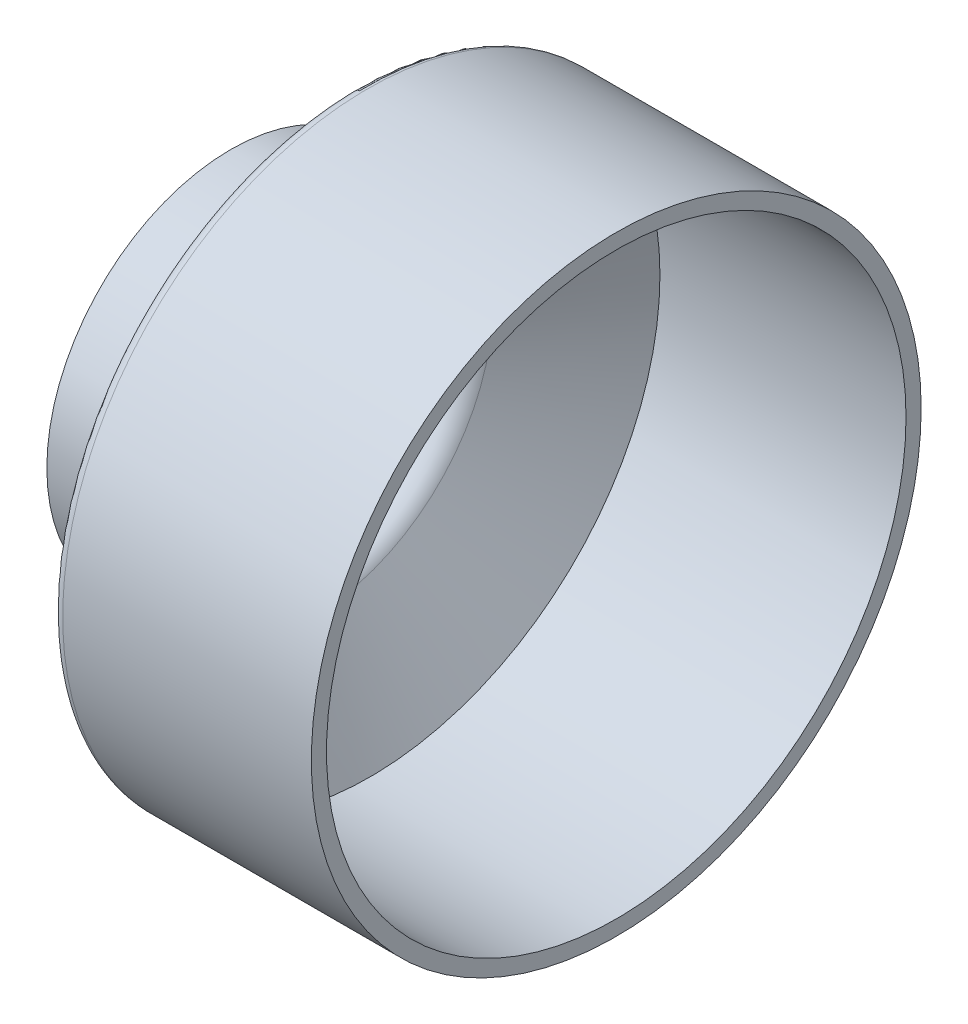
ISO-10303-21;
HEADER;
FILE_DESCRIPTION(('STEP AP214'),'2;1');
FILE_NAME('part.step','',(''),(''),'','','');
FILE_SCHEMA(('AUTOMOTIVE_DESIGN { 1 0 10303 214 1 1 1 1 }'));
ENDSEC;
DATA;
#1=APPLICATION_CONTEXT('core data for automotive mechanical design processes');
#2=APPLICATION_PROTOCOL_DEFINITION('international standard','automotive_design',2000,#1);
#3=PRODUCT_CONTEXT('',#1,'mechanical');
#4=PRODUCT('Part','Part','',(#3));
#5=PRODUCT_RELATED_PRODUCT_CATEGORY('part','',(#4));
#6=PRODUCT_DEFINITION_FORMATION('','',#4);
#7=PRODUCT_DEFINITION_CONTEXT('part definition',#1,'design');
#8=PRODUCT_DEFINITION('design','',#6,#7);
#9=PRODUCT_DEFINITION_SHAPE('','',#8);
#10=(LENGTH_UNIT() NAMED_UNIT(*) SI_UNIT(.MILLI.,.METRE.));
#11=(NAMED_UNIT(*) PLANE_ANGLE_UNIT() SI_UNIT($,.RADIAN.));
#12=(NAMED_UNIT(*) SI_UNIT($,.STERADIAN.) SOLID_ANGLE_UNIT());
#13=UNCERTAINTY_MEASURE_WITH_UNIT(LENGTH_MEASURE(1.E-05),#10,'distance_accuracy_value','');
#14=(GEOMETRIC_REPRESENTATION_CONTEXT(3) GLOBAL_UNCERTAINTY_ASSIGNED_CONTEXT((#13)) GLOBAL_UNIT_ASSIGNED_CONTEXT((#10,
#11,#12)) REPRESENTATION_CONTEXT('',''));
#15=CARTESIAN_POINT('',(0.,0.,0.));
#16=DIRECTION('',(0.,0.,1.));
#17=DIRECTION('',(1.,0.,0.));
#18=AXIS2_PLACEMENT_3D('',#15,#16,#17);
#19=CARTESIAN_POINT('',(0.,0.,0.));
#20=DIRECTION('',(1.,0.,0.));
#21=DIRECTION('',(0.,0.,-1.));
#22=AXIS2_PLACEMENT_3D('',#19,#20,#21);
#23=CYLINDRICAL_SURFACE('',#22,181.8084327405);
#24=CARTESIAN_POINT('',(212.897562504,0.,0.));
#25=DIRECTION('',(-1.,0.,0.));
#26=DIRECTION('',(0.,0.,-1.));
#27=AXIS2_PLACEMENT_3D('',#24,#25,#26);
#28=CIRCLE('',#27,181.8084327405);
#29=CARTESIAN_POINT('',(212.897562504,0.,-181.8084327405));
#30=VERTEX_POINT('',#29);
#31=EDGE_CURVE('E67',#30,#30,#28,.T.);
#32=ORIENTED_EDGE('',*,*,#31,.F.);
#33=EDGE_LOOP('',(#32));
#34=FACE_BOUND('',#33,.T.);
#35=CARTESIAN_POINT('',(58.5062769528827,0.,0.));
#36=DIRECTION('',(1.,0.,0.));
#37=DIRECTION('',(0.,0.,-1.));
#38=AXIS2_PLACEMENT_3D('',#35,#36,#37);
#39=CIRCLE('',#38,181.8084327405);
#40=CARTESIAN_POINT('',(58.5062769528827,0.,-181.8084327405));
#41=VERTEX_POINT('',#40);
#42=EDGE_CURVE('E10',#41,#41,#39,.T.);
#43=ORIENTED_EDGE('',*,*,#42,.F.);
#44=EDGE_LOOP('',(#43));
#45=FACE_BOUND('',#44,.T.);
#46=ADVANCED_FACE('F33',(#34,#45),#23,.F.);
#47=CARTESIAN_POINT('',(21.3226701718791,0.,0.));
#48=DIRECTION('',(1.,0.,0.));
#49=DIRECTION('',(0.,0.,-1.));
#50=AXIS2_PLACEMENT_3D('',#47,#48,#49);
#51=CONICAL_SURFACE('',#50,114.308927427012,1.06728366137702);
#52=ORIENTED_EDGE('',*,*,#42,.T.);
#53=EDGE_LOOP('',(#52));
#54=FACE_BOUND('',#53,.T.);
#55=CARTESIAN_POINT('',(21.3226701718791,0.,0.));
#56=DIRECTION('',(1.,0.,0.));
#57=DIRECTION('',(0.,0.,-1.));
#58=AXIS2_PLACEMENT_3D('',#55,#56,#57);
#59=CIRCLE('',#58,114.308927427012);
#60=CARTESIAN_POINT('',(21.3226701718791,0.,-114.308927427012));
#61=VERTEX_POINT('',#60);
#62=EDGE_CURVE('E39',#61,#61,#59,.T.);
#63=ORIENTED_EDGE('',*,*,#62,.F.);
#64=EDGE_LOOP('',(#63));
#65=FACE_BOUND('',#64,.T.);
#66=ADVANCED_FACE('F117',(#54,#65),#51,.F.);
#67=CARTESIAN_POINT('',(7.09015017062491,0.,0.));
#68=DIRECTION('',(1.,0.,0.));
#69=DIRECTION('',(0.,0.,-1.));
#70=AXIS2_PLACEMENT_3D('',#67,#68,#69);
#71=TOROIDAL_SURFACE('',#70,122.1492282525,16.2491520585);
#72=ORIENTED_EDGE('',*,*,#62,.T.);
#73=EDGE_LOOP('',(#72));
#74=FACE_BOUND('',#73,.T.);
#75=CARTESIAN_POINT('',(7.09015017062491,0.,0.));
#76=DIRECTION('',(1.,0.,0.));
#77=DIRECTION('',(0.,0.,-1.));
#78=AXIS2_PLACEMENT_3D('',#75,#76,#77);
#79=CIRCLE('',#78,105.900076194);
#80=CARTESIAN_POINT('',(7.09015017062491,0.,-105.900076194));
#81=VERTEX_POINT('',#80);
#82=EDGE_CURVE('E43',#81,#81,#79,.T.);
#83=ORIENTED_EDGE('',*,*,#82,.F.);
#84=EDGE_LOOP('',(#83));
#85=FACE_BOUND('',#84,.T.);
#86=ADVANCED_FACE('F122',(#74,#85),#71,.T.);
#87=CARTESIAN_POINT('',(0.,0.,0.));
#88=DIRECTION('',(1.,0.,0.));
#89=DIRECTION('',(0.,0.,-1.));
#90=AXIS2_PLACEMENT_3D('',#87,#88,#89);
#91=CYLINDRICAL_SURFACE('',#90,105.900076194);
#92=ORIENTED_EDGE('',*,*,#82,.T.);
#93=EDGE_LOOP('',(#92));
#94=FACE_BOUND('',#93,.T.);
#95=CARTESIAN_POINT('',(-28.9781701706876,0.,0.));
#96=DIRECTION('',(1.,0.,0.));
#97=DIRECTION('',(0.,0.,1.));
#98=AXIS2_PLACEMENT_3D('',#95,#96,#97);
#99=CIRCLE('',#98,105.900076194);
#100=CARTESIAN_POINT('',(-28.9781701706876,0.,105.900076194));
#101=VERTEX_POINT('',#100);
#102=EDGE_CURVE('E64',#101,#101,#99,.T.);
#103=ORIENTED_EDGE('',*,*,#102,.F.);
#104=EDGE_LOOP('',(#103));
#105=FACE_BOUND('',#104,.T.);
#106=ADVANCED_FACE('F105',(#94,#105),#91,.F.);
#107=CARTESIAN_POINT('',(0.,0.,0.));
#108=DIRECTION('',(1.,0.,0.));
#109=DIRECTION('',(0.,0.,-1.));
#110=AXIS2_PLACEMENT_3D('',#107,#108,#109);
#111=CYLINDRICAL_SURFACE('',#110,115.402650153);
#112=CARTESIAN_POINT('',(7.09015017062491,0.,0.));
#113=DIRECTION('',(1.,0.,0.));
#114=DIRECTION('',(0.,0.,-1.));
#115=AXIS2_PLACEMENT_3D('',#112,#113,#114);
#116=CIRCLE('',#115,115.402650153);
#117=CARTESIAN_POINT('',(7.09015017062491,0.,-115.402650153));
#118=VERTEX_POINT('',#117);
#119=EDGE_CURVE('E47',#118,#118,#116,.T.);
#120=ORIENTED_EDGE('',*,*,#119,.F.);
#121=EDGE_LOOP('',(#120));
#122=FACE_BOUND('',#121,.T.);
#123=CARTESIAN_POINT('',(-28.9781701706876,0.,0.));
#124=DIRECTION('',(-1.,0.,0.));
#125=DIRECTION('',(0.,0.,1.));
#126=AXIS2_PLACEMENT_3D('',#123,#124,#125);
#127=CIRCLE('',#126,115.402650153);
#128=CARTESIAN_POINT('',(-28.9781701706876,0.,115.402650153));
#129=VERTEX_POINT('',#128);
#130=EDGE_CURVE('E61',#129,#129,#127,.T.);
#131=ORIENTED_EDGE('',*,*,#130,.F.);
#132=EDGE_LOOP('',(#131));
#133=FACE_BOUND('',#132,.T.);
#134=ADVANCED_FACE('F99',(#122,#133),#111,.T.);
#135=CARTESIAN_POINT('',(7.09015017062491,0.,0.));
#136=DIRECTION('',(1.,0.,0.));
#137=DIRECTION('',(0.,0.,-1.));
#138=AXIS2_PLACEMENT_3D('',#135,#136,#137);
#139=TOROIDAL_SURFACE('',#138,122.1492282525,6.7465780995);
#140=CARTESIAN_POINT('',(12.999431306986,0.,0.));
#141=DIRECTION('',(1.,0.,0.));
#142=DIRECTION('',(0.,0.,-1.));
#143=AXIS2_PLACEMENT_3D('',#140,#141,#142);
#144=CIRCLE('',#143,118.893969045601);
#145=CARTESIAN_POINT('',(12.999431306986,0.,-118.893969045601));
#146=VERTEX_POINT('',#145);
#147=EDGE_CURVE('E52',#146,#146,#144,.T.);
#148=ORIENTED_EDGE('',*,*,#147,.F.);
#149=EDGE_LOOP('',(#148));
#150=FACE_BOUND('',#149,.T.);
#151=ORIENTED_EDGE('',*,*,#119,.T.);
#152=EDGE_LOOP('',(#151));
#153=FACE_BOUND('',#152,.T.);
#154=ADVANCED_FACE('F93',(#150,#153),#139,.F.);
#155=CARTESIAN_POINT('',(12.999431306986,0.,0.));
#156=DIRECTION('',(1.,0.,0.));
#157=DIRECTION('',(0.,0.,-1.));
#158=AXIS2_PLACEMENT_3D('',#155,#156,#157);
#159=CONICAL_SURFACE('',#158,118.893969045601,1.06728366137702);
#160=CARTESIAN_POINT('',(50.9686995499933,0.,0.));
#161=DIRECTION('',(1.,0.,0.));
#162=DIRECTION('',(0.,0.,-1.));
#163=AXIS2_PLACEMENT_3D('',#160,#161,#162);
#164=CIRCLE('',#163,187.819687806899);
#165=CARTESIAN_POINT('',(50.9686995499933,0.,-187.819687806899));
#166=VERTEX_POINT('',#165);
#167=EDGE_CURVE('E55',#166,#166,#164,.T.);
#168=ORIENTED_EDGE('',*,*,#167,.F.);
#169=EDGE_LOOP('',(#168));
#170=FACE_BOUND('',#169,.T.);
#171=ORIENTED_EDGE('',*,*,#147,.T.);
#172=EDGE_LOOP('',(#171));
#173=FACE_BOUND('',#172,.T.);
#174=ADVANCED_FACE('F87',(#170,#173),#159,.T.);
#175=CARTESIAN_POINT('',(56.8779806863544,0.,0.));
#176=DIRECTION('',(1.,0.,0.));
#177=DIRECTION('',(0.,0.,-1.));
#178=AXIS2_PLACEMENT_3D('',#175,#176,#177);
#179=TOROIDAL_SURFACE('',#178,184.5644286,6.7465780995);
#180=CARTESIAN_POINT('',(56.8779806863544,0.,0.));
#181=DIRECTION('',(1.,0.,0.));
#182=DIRECTION('',(0.,0.,-1.));
#183=AXIS2_PLACEMENT_3D('',#180,#181,#182);
#184=CIRCLE('',#183,191.3110066995);
#185=CARTESIAN_POINT('',(56.8779806863544,0.,-191.3110066995));
#186=VERTEX_POINT('',#185);
#187=EDGE_CURVE('E58',#186,#186,#184,.T.);
#188=ORIENTED_EDGE('',*,*,#187,.F.);
#189=EDGE_LOOP('',(#188));
#190=FACE_BOUND('',#189,.T.);
#191=ORIENTED_EDGE('',*,*,#167,.T.);
#192=EDGE_LOOP('',(#191));
#193=FACE_BOUND('',#192,.T.);
#194=ADVANCED_FACE('F81',(#190,#193),#179,.T.);
#195=CARTESIAN_POINT('',(0.,0.,0.));
#196=DIRECTION('',(1.,0.,0.));
#197=DIRECTION('',(0.,0.,-1.));
#198=AXIS2_PLACEMENT_3D('',#195,#196,#197);
#199=CYLINDRICAL_SURFACE('',#198,191.3110066995);
#200=CARTESIAN_POINT('',(212.897562504,0.,0.));
#201=DIRECTION('',(1.,0.,0.));
#202=DIRECTION('',(0.,0.,-1.));
#203=AXIS2_PLACEMENT_3D('',#200,#201,#202);
#204=CIRCLE('',#203,191.3110066995);
#205=CARTESIAN_POINT('',(212.897562504,0.,-191.3110066995));
#206=VERTEX_POINT('',#205);
#207=EDGE_CURVE('E70',#206,#206,#204,.T.);
#208=ORIENTED_EDGE('',*,*,#207,.F.);
#209=EDGE_LOOP('',(#208));
#210=FACE_BOUND('',#209,.T.);
#211=ORIENTED_EDGE('',*,*,#187,.T.);
#212=EDGE_LOOP('',(#211));
#213=FACE_BOUND('',#212,.T.);
#214=ADVANCED_FACE('F77',(#210,#213),#199,.T.);
#215=CARTESIAN_POINT('',(-28.9781701706876,0.,0.));
#216=DIRECTION('',(-1.,0.,0.));
#217=DIRECTION('',(0.,0.,1.));
#218=AXIS2_PLACEMENT_3D('',#215,#216,#217);
#219=PLANE('',#218);
#220=ORIENTED_EDGE('',*,*,#102,.T.);
#221=EDGE_LOOP('',(#220));
#222=FACE_BOUND('',#221,.T.);
#223=ORIENTED_EDGE('',*,*,#130,.T.);
#224=EDGE_LOOP('',(#223));
#225=FACE_BOUND('',#224,.T.);
#226=ADVANCED_FACE('F80',(#222,#225),#219,.T.);
#227=CARTESIAN_POINT('',(212.897562504,0.,0.));
#228=DIRECTION('',(1.,0.,0.));
#229=DIRECTION('',(0.,0.,-1.));
#230=AXIS2_PLACEMENT_3D('',#227,#228,#229);
#231=PLANE('',#230);
#232=ORIENTED_EDGE('',*,*,#207,.T.);
#233=EDGE_LOOP('',(#232));
#234=FACE_BOUND('',#233,.T.);
#235=ORIENTED_EDGE('',*,*,#31,.T.);
#236=EDGE_LOOP('',(#235));
#237=FACE_BOUND('',#236,.T.);
#238=ADVANCED_FACE('F74',(#234,#237),#231,.T.);
#239=CLOSED_SHELL('',(#46,#66,#86,#106,#134,#154,#174,#194,#214,#226,#238));
#240=MANIFOLD_SOLID_BREP('B2',#239);
#241=ADVANCED_BREP_SHAPE_REPRESENTATION('',(#18,#240),#14);
#242=SHAPE_DEFINITION_REPRESENTATION(#9,#241);
ENDSEC;
END-ISO-10303-21;
